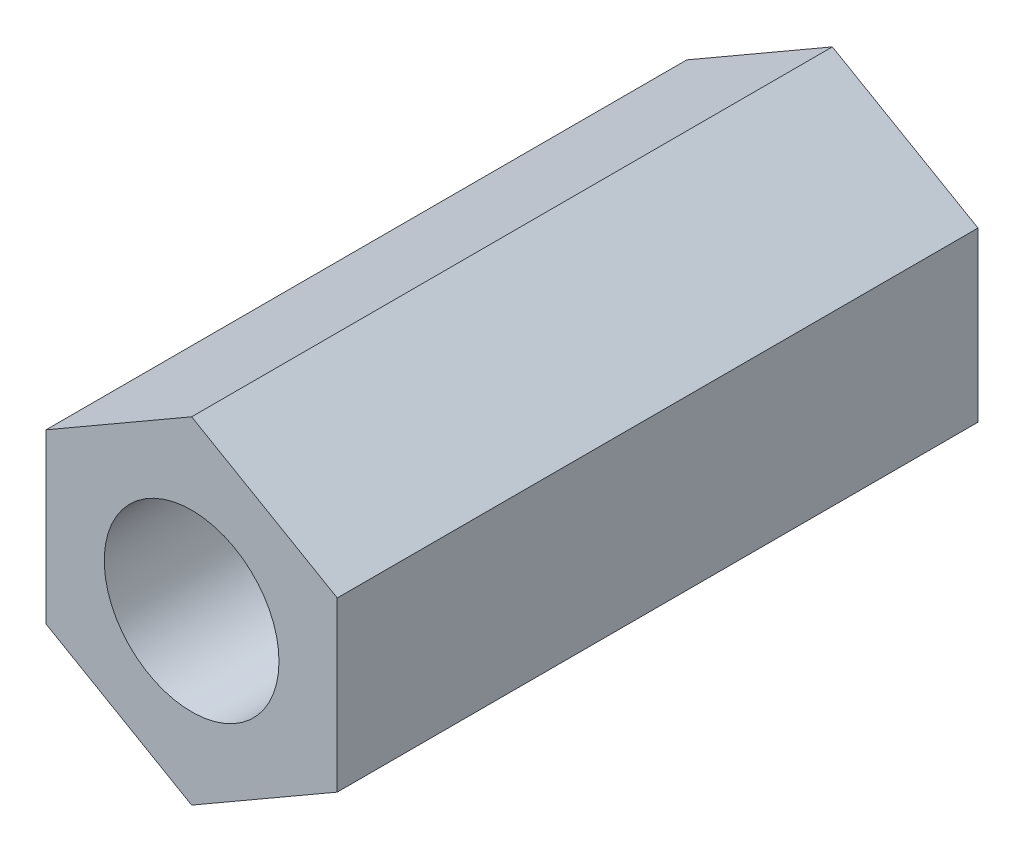
ISO-10303-21;
HEADER;
FILE_DESCRIPTION(('STEP AP214'),'2;1');
FILE_NAME('part.step','',(''),(''),'','','');
FILE_SCHEMA(('AUTOMOTIVE_DESIGN { 1 0 10303 214 1 1 1 1 }'));
ENDSEC;
DATA;
#1=APPLICATION_CONTEXT('core data for automotive mechanical design processes');
#2=APPLICATION_PROTOCOL_DEFINITION('international standard','automotive_design',2000,#1);
#3=PRODUCT_CONTEXT('',#1,'mechanical');
#4=PRODUCT('Part','Part','',(#3));
#5=PRODUCT_RELATED_PRODUCT_CATEGORY('part','',(#4));
#6=PRODUCT_DEFINITION_FORMATION('','',#4);
#7=PRODUCT_DEFINITION_CONTEXT('part definition',#1,'design');
#8=PRODUCT_DEFINITION('design','',#6,#7);
#9=PRODUCT_DEFINITION_SHAPE('','',#8);
#10=(LENGTH_UNIT() NAMED_UNIT(*) SI_UNIT(.MILLI.,.METRE.));
#11=(NAMED_UNIT(*) PLANE_ANGLE_UNIT() SI_UNIT($,.RADIAN.));
#12=(NAMED_UNIT(*) SI_UNIT($,.STERADIAN.) SOLID_ANGLE_UNIT());
#13=UNCERTAINTY_MEASURE_WITH_UNIT(LENGTH_MEASURE(1.E-05),#10,'distance_accuracy_value','');
#14=(GEOMETRIC_REPRESENTATION_CONTEXT(3) GLOBAL_UNCERTAINTY_ASSIGNED_CONTEXT((#13)) GLOBAL_UNIT_ASSIGNED_CONTEXT((#10,
#11,#12)) REPRESENTATION_CONTEXT('',''));
#15=CARTESIAN_POINT('',(0.,0.,0.));
#16=DIRECTION('',(0.,0.,1.));
#17=DIRECTION('',(1.,0.,0.));
#18=AXIS2_PLACEMENT_3D('',#15,#16,#17);
#19=CARTESIAN_POINT('',(0.,0.,11.));
#20=DIRECTION('',(0.,0.,1.));
#21=DIRECTION('',(1.,0.,0.));
#22=AXIS2_PLACEMENT_3D('',#19,#20,#21);
#23=PLANE('',#22);
#24=DIRECTION('',(0.,1.,0.));
#25=VECTOR('',#24,1.);
#26=CARTESIAN_POINT('',(2.5,-1.44337567297407,11.));
#27=LINE('',#26,#25);
#28=CARTESIAN_POINT('',(2.5,-1.44337567297407,11.));
#29=VERTEX_POINT('',#28);
#30=CARTESIAN_POINT('',(2.5,1.44337567297406,11.));
#31=VERTEX_POINT('',#30);
#32=EDGE_CURVE('E129',#29,#31,#27,.T.);
#33=ORIENTED_EDGE('',*,*,#32,.T.);
#34=DIRECTION('',(-0.866025403784439,0.5,0.));
#35=VECTOR('',#34,1.);
#36=CARTESIAN_POINT('',(2.5,1.44337567297406,11.));
#37=LINE('',#36,#35);
#38=CARTESIAN_POINT('',(0.,2.88675134594813,11.));
#39=VERTEX_POINT('',#38);
#40=EDGE_CURVE('E87',#31,#39,#37,.T.);
#41=ORIENTED_EDGE('',*,*,#40,.T.);
#42=DIRECTION('',(-0.866025403784439,-0.5,0.));
#43=VECTOR('',#42,1.);
#44=CARTESIAN_POINT('',(0.,2.88675134594813,11.));
#45=LINE('',#44,#43);
#46=CARTESIAN_POINT('',(-2.5,1.44337567297406,11.));
#47=VERTEX_POINT('',#46);
#48=EDGE_CURVE('E100',#39,#47,#45,.T.);
#49=ORIENTED_EDGE('',*,*,#48,.T.);
#50=DIRECTION('',(0.,-1.,0.));
#51=VECTOR('',#50,1.);
#52=CARTESIAN_POINT('',(-2.5,1.44337567297406,11.));
#53=LINE('',#52,#51);
#54=CARTESIAN_POINT('',(-2.5,-1.44337567297406,11.));
#55=VERTEX_POINT('',#54);
#56=EDGE_CURVE('E94',#47,#55,#53,.T.);
#57=ORIENTED_EDGE('',*,*,#56,.T.);
#58=DIRECTION('',(0.866025403784439,-0.5,0.));
#59=VECTOR('',#58,1.);
#60=CARTESIAN_POINT('',(-2.5,-1.44337567297406,11.));
#61=LINE('',#60,#59);
#62=CARTESIAN_POINT('',(0.,-2.88675134594813,11.));
#63=VERTEX_POINT('',#62);
#64=EDGE_CURVE('E98',#55,#63,#61,.T.);
#65=ORIENTED_EDGE('',*,*,#64,.T.);
#66=DIRECTION('',(0.866025403784439,0.5,0.));
#67=VECTOR('',#66,1.);
#68=CARTESIAN_POINT('',(0.,-2.88675134594813,11.));
#69=LINE('',#68,#67);
#70=EDGE_CURVE('E50',#63,#29,#69,.T.);
#71=ORIENTED_EDGE('',*,*,#70,.T.);
#72=EDGE_LOOP('',(#33,#41,#49,#57,#65,#71));
#73=FACE_BOUND('',#72,.T.);
#74=CARTESIAN_POINT('',(0.,0.,11.));
#75=DIRECTION('',(0.,0.,1.));
#76=DIRECTION('',(1.,0.,0.));
#77=AXIS2_PLACEMENT_3D('',#74,#75,#76);
#78=CIRCLE('',#77,1.5);
#79=CARTESIAN_POINT('',(1.5,0.,11.));
#80=VERTEX_POINT('',#79);
#81=EDGE_CURVE('E122',#80,#80,#78,.T.);
#82=ORIENTED_EDGE('',*,*,#81,.F.);
#83=EDGE_LOOP('',(#82));
#84=FACE_BOUND('',#83,.T.);
#85=ADVANCED_FACE('F33',(#73,#84),#23,.T.);
#86=CARTESIAN_POINT('',(0.,0.,0.));
#87=DIRECTION('',(0.,0.,1.));
#88=DIRECTION('',(1.,0.,0.));
#89=AXIS2_PLACEMENT_3D('',#86,#87,#88);
#90=PLANE('',#89);
#91=DIRECTION('',(0.,1.,0.));
#92=VECTOR('',#91,1.);
#93=CARTESIAN_POINT('',(2.5,-1.44337567297407,0.));
#94=LINE('',#93,#92);
#95=CARTESIAN_POINT('',(2.5,-1.44337567297407,0.));
#96=VERTEX_POINT('',#95);
#97=CARTESIAN_POINT('',(2.5,1.44337567297406,0.));
#98=VERTEX_POINT('',#97);
#99=EDGE_CURVE('E118',#96,#98,#94,.T.);
#100=ORIENTED_EDGE('',*,*,#99,.F.);
#101=DIRECTION('',(0.866025403784439,0.5,0.));
#102=VECTOR('',#101,1.);
#103=CARTESIAN_POINT('',(0.,-2.88675134594813,0.));
#104=LINE('',#103,#102);
#105=CARTESIAN_POINT('',(0.,-2.88675134594813,0.));
#106=VERTEX_POINT('',#105);
#107=EDGE_CURVE('E79',#106,#96,#104,.T.);
#108=ORIENTED_EDGE('',*,*,#107,.F.);
#109=DIRECTION('',(0.866025403784439,-0.5,0.));
#110=VECTOR('',#109,1.);
#111=CARTESIAN_POINT('',(-2.5,-1.44337567297406,0.));
#112=LINE('',#111,#110);
#113=CARTESIAN_POINT('',(-2.5,-1.44337567297406,0.));
#114=VERTEX_POINT('',#113);
#115=EDGE_CURVE('E73',#114,#106,#112,.T.);
#116=ORIENTED_EDGE('',*,*,#115,.F.);
#117=DIRECTION('',(0.,-1.,0.));
#118=VECTOR('',#117,1.);
#119=CARTESIAN_POINT('',(-2.5,1.44337567297406,0.));
#120=LINE('',#119,#118);
#121=CARTESIAN_POINT('',(-2.5,1.44337567297406,0.));
#122=VERTEX_POINT('',#121);
#123=EDGE_CURVE('E108',#122,#114,#120,.T.);
#124=ORIENTED_EDGE('',*,*,#123,.F.);
#125=DIRECTION('',(-0.866025403784439,-0.5,0.));
#126=VECTOR('',#125,1.);
#127=CARTESIAN_POINT('',(0.,2.88675134594813,0.));
#128=LINE('',#127,#126);
#129=CARTESIAN_POINT('',(0.,2.88675134594813,0.));
#130=VERTEX_POINT('',#129);
#131=EDGE_CURVE('E124',#130,#122,#128,.T.);
#132=ORIENTED_EDGE('',*,*,#131,.F.);
#133=DIRECTION('',(-0.866025403784439,0.5,0.));
#134=VECTOR('',#133,1.);
#135=CARTESIAN_POINT('',(2.5,1.44337567297406,0.));
#136=LINE('',#135,#134);
#137=EDGE_CURVE('E121',#98,#130,#136,.T.);
#138=ORIENTED_EDGE('',*,*,#137,.F.);
#139=EDGE_LOOP('',(#100,#108,#116,#124,#132,#138));
#140=FACE_BOUND('',#139,.T.);
#141=CARTESIAN_POINT('',(0.,0.,0.));
#142=DIRECTION('',(0.,0.,1.));
#143=DIRECTION('',(1.,0.,0.));
#144=AXIS2_PLACEMENT_3D('',#141,#142,#143);
#145=CIRCLE('',#144,1.5);
#146=CARTESIAN_POINT('',(1.5,0.,0.));
#147=VERTEX_POINT('',#146);
#148=EDGE_CURVE('E222',#147,#147,#145,.T.);
#149=ORIENTED_EDGE('',*,*,#148,.T.);
#150=EDGE_LOOP('',(#149));
#151=FACE_BOUND('',#150,.T.);
#152=ADVANCED_FACE('F138',(#140,#151),#90,.F.);
#153=CARTESIAN_POINT('',(2.5,-1.44337567297407,11.));
#154=DIRECTION('',(-1.,0.,0.));
#155=DIRECTION('',(0.,0.,1.));
#156=AXIS2_PLACEMENT_3D('',#153,#154,#155);
#157=PLANE('',#156);
#158=ORIENTED_EDGE('',*,*,#99,.T.);
#159=DIRECTION('',(0.,0.,-1.));
#160=VECTOR('',#159,1.);
#161=CARTESIAN_POINT('',(2.5,1.44337567297406,11.));
#162=LINE('',#161,#160);
#163=EDGE_CURVE('E11',#31,#98,#162,.T.);
#164=ORIENTED_EDGE('',*,*,#163,.F.);
#165=ORIENTED_EDGE('',*,*,#32,.F.);
#166=DIRECTION('',(0.,0.,-1.));
#167=VECTOR('',#166,1.);
#168=CARTESIAN_POINT('',(2.5,-1.44337567297407,11.));
#169=LINE('',#168,#167);
#170=EDGE_CURVE('E114',#29,#96,#169,.T.);
#171=ORIENTED_EDGE('',*,*,#170,.T.);
#172=EDGE_LOOP('',(#158,#164,#165,#171));
#173=FACE_BOUND('',#172,.T.);
#174=ADVANCED_FACE('F35',(#173),#157,.F.);
#175=CARTESIAN_POINT('',(2.5,1.44337567297406,11.));
#176=DIRECTION('',(-0.5,-0.866025403784438,0.));
#177=DIRECTION('',(0.866025403784439,-0.5,0.));
#178=AXIS2_PLACEMENT_3D('',#175,#176,#177);
#179=PLANE('',#178);
#180=ORIENTED_EDGE('',*,*,#137,.T.);
#181=DIRECTION('',(0.,0.,-1.));
#182=VECTOR('',#181,1.);
#183=CARTESIAN_POINT('',(0.,2.88675134594813,11.));
#184=LINE('',#183,#182);
#185=EDGE_CURVE('E42',#39,#130,#184,.T.);
#186=ORIENTED_EDGE('',*,*,#185,.F.);
#187=ORIENTED_EDGE('',*,*,#40,.F.);
#188=ORIENTED_EDGE('',*,*,#163,.T.);
#189=EDGE_LOOP('',(#180,#186,#187,#188));
#190=FACE_BOUND('',#189,.T.);
#191=ADVANCED_FACE('F163',(#190),#179,.F.);
#192=CARTESIAN_POINT('',(0.,2.88675134594813,11.));
#193=DIRECTION('',(0.5,-0.866025403784439,0.));
#194=DIRECTION('',(0.866025403784439,0.5,0.));
#195=AXIS2_PLACEMENT_3D('',#192,#193,#194);
#196=PLANE('',#195);
#197=ORIENTED_EDGE('',*,*,#131,.T.);
#198=DIRECTION('',(0.,0.,-1.));
#199=VECTOR('',#198,1.);
#200=CARTESIAN_POINT('',(-2.5,1.44337567297406,11.));
#201=LINE('',#200,#199);
#202=EDGE_CURVE('E109',#47,#122,#201,.T.);
#203=ORIENTED_EDGE('',*,*,#202,.F.);
#204=ORIENTED_EDGE('',*,*,#48,.F.);
#205=ORIENTED_EDGE('',*,*,#185,.T.);
#206=EDGE_LOOP('',(#197,#203,#204,#205));
#207=FACE_BOUND('',#206,.T.);
#208=ADVANCED_FACE('F135',(#207),#196,.F.);
#209=CARTESIAN_POINT('',(-2.5,1.44337567297406,11.));
#210=DIRECTION('',(1.,0.,0.));
#211=DIRECTION('',(0.,1.,0.));
#212=AXIS2_PLACEMENT_3D('',#209,#210,#211);
#213=PLANE('',#212);
#214=ORIENTED_EDGE('',*,*,#123,.T.);
#215=DIRECTION('',(0.,0.,-1.));
#216=VECTOR('',#215,1.);
#217=CARTESIAN_POINT('',(-2.5,-1.44337567297406,11.));
#218=LINE('',#217,#216);
#219=EDGE_CURVE('E105',#55,#114,#218,.T.);
#220=ORIENTED_EDGE('',*,*,#219,.F.);
#221=ORIENTED_EDGE('',*,*,#56,.F.);
#222=ORIENTED_EDGE('',*,*,#202,.T.);
#223=EDGE_LOOP('',(#214,#220,#221,#222));
#224=FACE_BOUND('',#223,.T.);
#225=ADVANCED_FACE('F106',(#224),#213,.F.);
#226=CARTESIAN_POINT('',(-2.5,-1.44337567297406,11.));
#227=DIRECTION('',(0.5,0.866025403784439,0.));
#228=DIRECTION('',(-0.866025403784439,0.5,0.));
#229=AXIS2_PLACEMENT_3D('',#226,#227,#228);
#230=PLANE('',#229);
#231=ORIENTED_EDGE('',*,*,#115,.T.);
#232=DIRECTION('',(0.,0.,-1.));
#233=VECTOR('',#232,1.);
#234=CARTESIAN_POINT('',(0.,-2.88675134594813,11.));
#235=LINE('',#234,#233);
#236=EDGE_CURVE('E110',#63,#106,#235,.T.);
#237=ORIENTED_EDGE('',*,*,#236,.F.);
#238=ORIENTED_EDGE('',*,*,#64,.F.);
#239=ORIENTED_EDGE('',*,*,#219,.T.);
#240=EDGE_LOOP('',(#231,#237,#238,#239));
#241=FACE_BOUND('',#240,.T.);
#242=ADVANCED_FACE('F112',(#241),#230,.F.);
#243=CARTESIAN_POINT('',(0.,-2.88675134594813,11.));
#244=DIRECTION('',(-0.5,0.866025403784439,0.));
#245=DIRECTION('',(-0.866025403784439,-0.5,0.));
#246=AXIS2_PLACEMENT_3D('',#243,#244,#245);
#247=PLANE('',#246);
#248=ORIENTED_EDGE('',*,*,#107,.T.);
#249=ORIENTED_EDGE('',*,*,#170,.F.);
#250=ORIENTED_EDGE('',*,*,#70,.F.);
#251=ORIENTED_EDGE('',*,*,#236,.T.);
#252=EDGE_LOOP('',(#248,#249,#250,#251));
#253=FACE_BOUND('',#252,.T.);
#254=ADVANCED_FACE('F143',(#253),#247,.F.);
#255=CARTESIAN_POINT('',(0.,0.,11.));
#256=DIRECTION('',(0.,0.,-1.));
#257=DIRECTION('',(-1.,0.,0.));
#258=AXIS2_PLACEMENT_3D('',#255,#256,#257);
#259=CYLINDRICAL_SURFACE('',#258,1.5);
#260=ORIENTED_EDGE('',*,*,#81,.T.);
#261=EDGE_LOOP('',(#260));
#262=FACE_BOUND('',#261,.T.);
#263=ORIENTED_EDGE('',*,*,#148,.F.);
#264=EDGE_LOOP('',(#263));
#265=FACE_BOUND('',#264,.T.);
#266=ADVANCED_FACE('F145',(#262,#265),#259,.F.);
#267=CLOSED_SHELL('',(#85,#152,#174,#191,#208,#225,#242,#254,#266));
#268=MANIFOLD_SOLID_BREP('B2',#267);
#269=ADVANCED_BREP_SHAPE_REPRESENTATION('',(#18,#268),#14);
#270=SHAPE_DEFINITION_REPRESENTATION(#9,#269);
ENDSEC;
END-ISO-10303-21;
